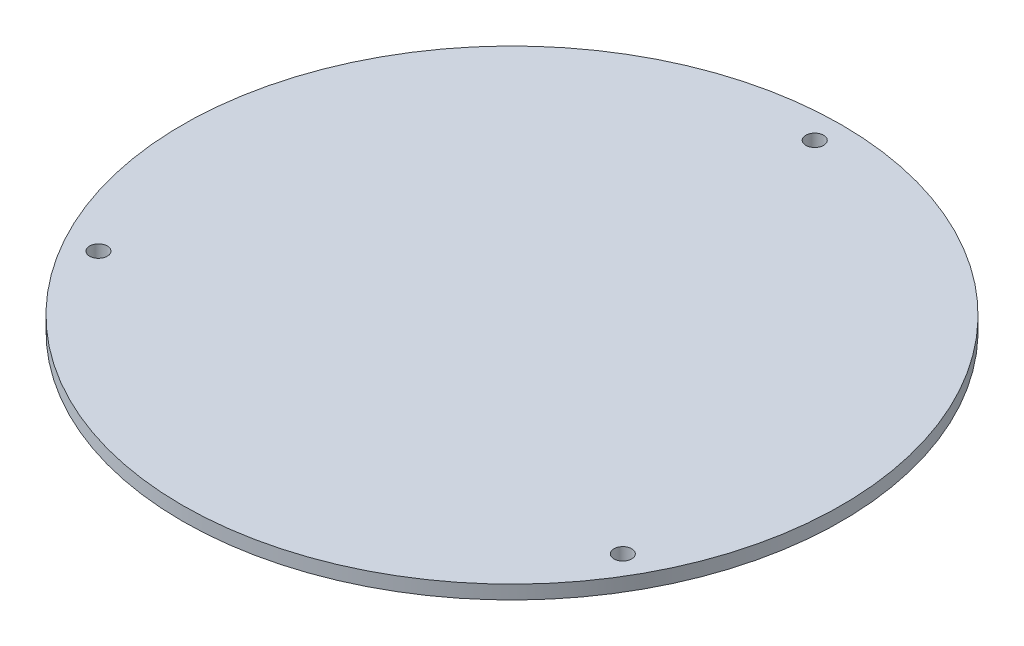
ISO-10303-21;
HEADER;
FILE_DESCRIPTION(('STEP AP214'),'2;1');
FILE_NAME('part.step','',(''),(''),'','','');
FILE_SCHEMA(('AUTOMOTIVE_DESIGN { 1 0 10303 214 1 1 1 1 }'));
ENDSEC;
DATA;
#1=APPLICATION_CONTEXT('core data for automotive mechanical design processes');
#2=APPLICATION_PROTOCOL_DEFINITION('international standard','automotive_design',2000,#1);
#3=PRODUCT_CONTEXT('',#1,'mechanical');
#4=PRODUCT('Part','Part','',(#3));
#5=PRODUCT_RELATED_PRODUCT_CATEGORY('part','',(#4));
#6=PRODUCT_DEFINITION_FORMATION('','',#4);
#7=PRODUCT_DEFINITION_CONTEXT('part definition',#1,'design');
#8=PRODUCT_DEFINITION('design','',#6,#7);
#9=PRODUCT_DEFINITION_SHAPE('','',#8);
#10=(LENGTH_UNIT() NAMED_UNIT(*) SI_UNIT(.MILLI.,.METRE.));
#11=(NAMED_UNIT(*) PLANE_ANGLE_UNIT() SI_UNIT($,.RADIAN.));
#12=(NAMED_UNIT(*) SI_UNIT($,.STERADIAN.) SOLID_ANGLE_UNIT());
#13=UNCERTAINTY_MEASURE_WITH_UNIT(LENGTH_MEASURE(1.E-05),#10,'distance_accuracy_value','');
#14=(GEOMETRIC_REPRESENTATION_CONTEXT(3) GLOBAL_UNCERTAINTY_ASSIGNED_CONTEXT((#13)) GLOBAL_UNIT_ASSIGNED_CONTEXT((#10,
#11,#12)) REPRESENTATION_CONTEXT('',''));
#15=CARTESIAN_POINT('',(0.,0.,0.));
#16=DIRECTION('',(0.,0.,1.));
#17=DIRECTION('',(1.,0.,0.));
#18=AXIS2_PLACEMENT_3D('',#15,#16,#17);
#19=CARTESIAN_POINT('',(0.,6.35,0.));
#20=DIRECTION('',(0.,-1.,0.));
#21=DIRECTION('',(0.,0.,-1.));
#22=AXIS2_PLACEMENT_3D('',#19,#20,#21);
#23=CYLINDRICAL_SURFACE('',#22,152.4);
#24=CARTESIAN_POINT('',(0.,6.35,0.));
#25=DIRECTION('',(0.,1.,0.));
#26=DIRECTION('',(0.,0.,1.));
#27=AXIS2_PLACEMENT_3D('',#24,#25,#26);
#28=CIRCLE('',#27,152.4);
#29=CARTESIAN_POINT('',(0.,6.35,152.4));
#30=VERTEX_POINT('',#29);
#31=EDGE_CURVE('E10',#30,#30,#28,.T.);
#32=ORIENTED_EDGE('',*,*,#31,.F.);
#33=EDGE_LOOP('',(#32));
#34=FACE_BOUND('',#33,.T.);
#35=CARTESIAN_POINT('',(0.,0.,0.));
#36=DIRECTION('',(0.,1.,0.));
#37=DIRECTION('',(0.,0.,1.));
#38=AXIS2_PLACEMENT_3D('',#35,#36,#37);
#39=CIRCLE('',#38,152.4);
#40=CARTESIAN_POINT('',(0.,0.,152.4));
#41=VERTEX_POINT('',#40);
#42=EDGE_CURVE('E37',#41,#41,#39,.T.);
#43=ORIENTED_EDGE('',*,*,#42,.T.);
#44=EDGE_LOOP('',(#43));
#45=FACE_BOUND('',#44,.T.);
#46=ADVANCED_FACE('F34',(#34,#45),#23,.T.);
#47=CARTESIAN_POINT('',(0.,6.35,0.));
#48=DIRECTION('',(0.,1.,0.));
#49=DIRECTION('',(0.,0.,1.));
#50=AXIS2_PLACEMENT_3D('',#47,#48,#49);
#51=PLANE('',#50);
#52=CARTESIAN_POINT('',(-121.243556529822,6.35,69.9999999999989));
#53=DIRECTION('',(0.,1.,0.));
#54=DIRECTION('',(0.866025403784443,0.,-0.499999999999992));
#55=AXIS2_PLACEMENT_3D('',#52,#53,#54);
#56=CIRCLE('',#55,4.10000000000022);
#57=CARTESIAN_POINT('',(-117.692852374306,6.35,67.9499999999988));
#58=VERTEX_POINT('',#57);
#59=EDGE_CURVE('E64',#58,#58,#56,.T.);
#60=ORIENTED_EDGE('',*,*,#59,.F.);
#61=EDGE_LOOP('',(#60));
#62=FACE_BOUND('',#61,.T.);
#63=CARTESIAN_POINT('',(121.243556529821,6.35,70.0000000000006));
#64=DIRECTION('',(0.,1.,0.));
#65=DIRECTION('',(-0.866025403784436,0.,-0.500000000000004));
#66=AXIS2_PLACEMENT_3D('',#63,#64,#65);
#67=CIRCLE('',#66,4.10000000000022);
#68=CARTESIAN_POINT('',(117.692852374305,6.35,67.9500000000005));
#69=VERTEX_POINT('',#68);
#70=EDGE_CURVE('E57',#69,#69,#67,.T.);
#71=ORIENTED_EDGE('',*,*,#70,.F.);
#72=EDGE_LOOP('',(#71));
#73=FACE_BOUND('',#72,.T.);
#74=CARTESIAN_POINT('',(0.,6.35,-140.));
#75=DIRECTION('',(0.,1.,0.));
#76=DIRECTION('',(0.,0.,1.));
#77=AXIS2_PLACEMENT_3D('',#74,#75,#76);
#78=CIRCLE('',#77,4.10000000000022);
#79=CARTESIAN_POINT('',(0.,6.35,-135.9));
#80=VERTEX_POINT('',#79);
#81=EDGE_CURVE('E50',#80,#80,#78,.T.);
#82=ORIENTED_EDGE('',*,*,#81,.F.);
#83=EDGE_LOOP('',(#82));
#84=FACE_BOUND('',#83,.T.);
#85=ORIENTED_EDGE('',*,*,#31,.T.);
#86=EDGE_LOOP('',(#85));
#87=FACE_BOUND('',#86,.T.);
#88=ADVANCED_FACE('F82',(#62,#73,#84,#87),#51,.T.);
#89=CARTESIAN_POINT('',(0.,0.,0.));
#90=DIRECTION('',(0.,1.,0.));
#91=DIRECTION('',(0.,0.,1.));
#92=AXIS2_PLACEMENT_3D('',#89,#90,#91);
#93=PLANE('',#92);
#94=CARTESIAN_POINT('',(-121.243556529822,0.,69.9999999999989));
#95=DIRECTION('',(0.,1.,0.));
#96=DIRECTION('',(0.866025403784443,0.,-0.499999999999992));
#97=AXIS2_PLACEMENT_3D('',#94,#95,#96);
#98=CIRCLE('',#97,4.10000000000022);
#99=CARTESIAN_POINT('',(-117.692852374306,0.,67.9499999999988));
#100=VERTEX_POINT('',#99);
#101=EDGE_CURVE('E61',#100,#100,#98,.T.);
#102=ORIENTED_EDGE('',*,*,#101,.T.);
#103=EDGE_LOOP('',(#102));
#104=FACE_BOUND('',#103,.T.);
#105=CARTESIAN_POINT('',(121.243556529821,0.,70.0000000000006));
#106=DIRECTION('',(0.,1.,0.));
#107=DIRECTION('',(-0.866025403784436,0.,-0.500000000000004));
#108=AXIS2_PLACEMENT_3D('',#105,#106,#107);
#109=CIRCLE('',#108,4.10000000000022);
#110=CARTESIAN_POINT('',(117.692852374305,0.,67.9500000000005));
#111=VERTEX_POINT('',#110);
#112=EDGE_CURVE('E54',#111,#111,#109,.T.);
#113=ORIENTED_EDGE('',*,*,#112,.T.);
#114=EDGE_LOOP('',(#113));
#115=FACE_BOUND('',#114,.T.);
#116=CARTESIAN_POINT('',(0.,0.,-140.));
#117=DIRECTION('',(0.,1.,0.));
#118=DIRECTION('',(0.,0.,1.));
#119=AXIS2_PLACEMENT_3D('',#116,#117,#118);
#120=CIRCLE('',#119,4.10000000000022);
#121=CARTESIAN_POINT('',(0.,0.,-135.9));
#122=VERTEX_POINT('',#121);
#123=EDGE_CURVE('E48',#122,#122,#120,.T.);
#124=ORIENTED_EDGE('',*,*,#123,.T.);
#125=EDGE_LOOP('',(#124));
#126=FACE_BOUND('',#125,.T.);
#127=ORIENTED_EDGE('',*,*,#42,.F.);
#128=EDGE_LOOP('',(#127));
#129=FACE_BOUND('',#128,.T.);
#130=ADVANCED_FACE('F72',(#104,#115,#126,#129),#93,.F.);
#131=CARTESIAN_POINT('',(0.,0.,-140.));
#132=DIRECTION('',(0.,1.,0.));
#133=DIRECTION('',(0.,0.,1.));
#134=AXIS2_PLACEMENT_3D('',#131,#132,#133);
#135=CYLINDRICAL_SURFACE('',#134,4.10000000000022);
#136=ORIENTED_EDGE('',*,*,#123,.F.);
#137=EDGE_LOOP('',(#136));
#138=FACE_BOUND('',#137,.T.);
#139=ORIENTED_EDGE('',*,*,#81,.T.);
#140=EDGE_LOOP('',(#139));
#141=FACE_BOUND('',#140,.T.);
#142=ADVANCED_FACE('F90',(#138,#141),#135,.F.);
#143=CARTESIAN_POINT('',(121.243556529821,0.,70.0000000000006));
#144=DIRECTION('',(0.,1.,0.));
#145=DIRECTION('',(0.,0.,1.));
#146=AXIS2_PLACEMENT_3D('',#143,#144,#145);
#147=CYLINDRICAL_SURFACE('',#146,4.10000000000022);
#148=ORIENTED_EDGE('',*,*,#112,.F.);
#149=EDGE_LOOP('',(#148));
#150=FACE_BOUND('',#149,.T.);
#151=ORIENTED_EDGE('',*,*,#70,.T.);
#152=EDGE_LOOP('',(#151));
#153=FACE_BOUND('',#152,.T.);
#154=ADVANCED_FACE('F78',(#150,#153),#147,.F.);
#155=CARTESIAN_POINT('',(-121.243556529822,0.,69.9999999999989));
#156=DIRECTION('',(0.,1.,0.));
#157=DIRECTION('',(0.,0.,1.));
#158=AXIS2_PLACEMENT_3D('',#155,#156,#157);
#159=CYLINDRICAL_SURFACE('',#158,4.10000000000022);
#160=ORIENTED_EDGE('',*,*,#101,.F.);
#161=EDGE_LOOP('',(#160));
#162=FACE_BOUND('',#161,.T.);
#163=ORIENTED_EDGE('',*,*,#59,.T.);
#164=EDGE_LOOP('',(#163));
#165=FACE_BOUND('',#164,.T.);
#166=ADVANCED_FACE('F75',(#162,#165),#159,.F.);
#167=CLOSED_SHELL('',(#46,#88,#130,#142,#154,#166));
#168=MANIFOLD_SOLID_BREP('B2',#167);
#169=ADVANCED_BREP_SHAPE_REPRESENTATION('',(#18,#168),#14);
#170=SHAPE_DEFINITION_REPRESENTATION(#9,#169);
ENDSEC;
END-ISO-10303-21;
